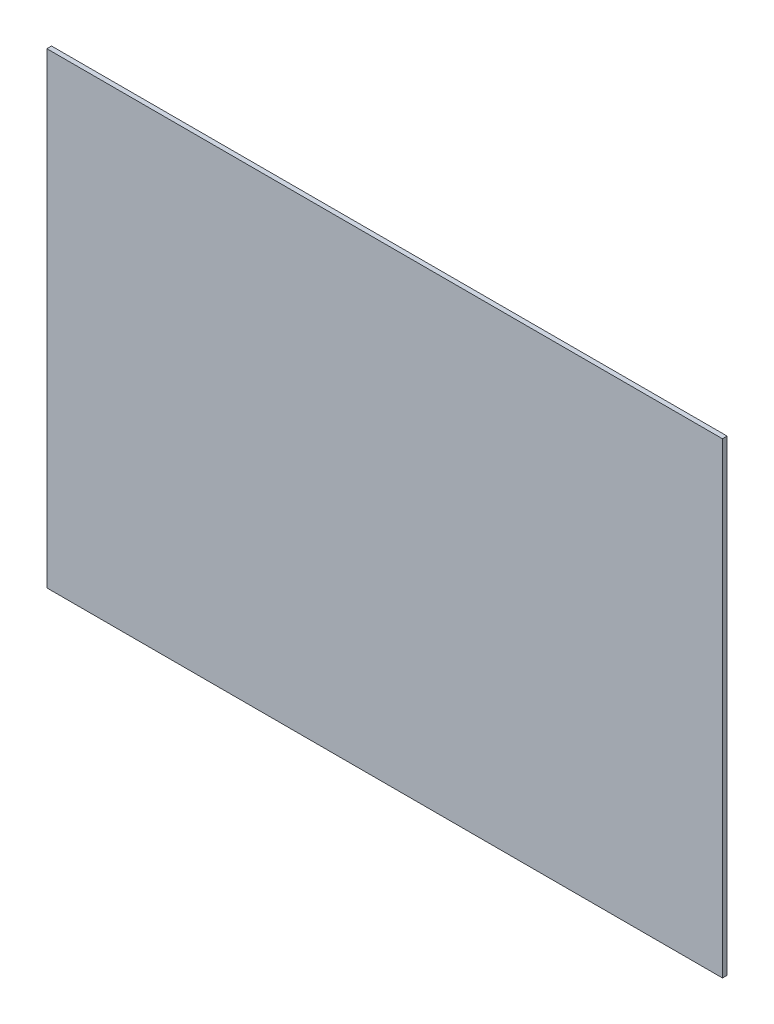
ISO-10303-21;
HEADER;
FILE_DESCRIPTION(('STEP AP214'),'2;1');
FILE_NAME('part.step','',(''),(''),'','','');
FILE_SCHEMA(('AUTOMOTIVE_DESIGN { 1 0 10303 214 1 1 1 1 }'));
ENDSEC;
DATA;
#1=APPLICATION_CONTEXT('core data for automotive mechanical design processes');
#2=APPLICATION_PROTOCOL_DEFINITION('international standard','automotive_design',2000,#1);
#3=PRODUCT_CONTEXT('',#1,'mechanical');
#4=PRODUCT('Part','Part','',(#3));
#5=PRODUCT_RELATED_PRODUCT_CATEGORY('part','',(#4));
#6=PRODUCT_DEFINITION_FORMATION('','',#4);
#7=PRODUCT_DEFINITION_CONTEXT('part definition',#1,'design');
#8=PRODUCT_DEFINITION('design','',#6,#7);
#9=PRODUCT_DEFINITION_SHAPE('','',#8);
#10=(LENGTH_UNIT() NAMED_UNIT(*) SI_UNIT(.MILLI.,.METRE.));
#11=(NAMED_UNIT(*) PLANE_ANGLE_UNIT() SI_UNIT($,.RADIAN.));
#12=(NAMED_UNIT(*) SI_UNIT($,.STERADIAN.) SOLID_ANGLE_UNIT());
#13=UNCERTAINTY_MEASURE_WITH_UNIT(LENGTH_MEASURE(1.E-05),#10,'distance_accuracy_value','');
#14=(GEOMETRIC_REPRESENTATION_CONTEXT(3) GLOBAL_UNCERTAINTY_ASSIGNED_CONTEXT((#13)) GLOBAL_UNIT_ASSIGNED_CONTEXT((#10,
#11,#12)) REPRESENTATION_CONTEXT('',''));
#15=CARTESIAN_POINT('',(0.,0.,0.));
#16=DIRECTION('',(0.,0.,1.));
#17=DIRECTION('',(1.,0.,0.));
#18=AXIS2_PLACEMENT_3D('',#15,#16,#17);
#19=CARTESIAN_POINT('',(217.,150.,3.));
#20=DIRECTION('',(-1.,0.,0.));
#21=DIRECTION('',(0.,-1.,0.));
#22=AXIS2_PLACEMENT_3D('',#19,#20,#21);
#23=PLANE('',#22);
#24=DIRECTION('',(0.,1.,0.));
#25=VECTOR('',#24,1.);
#26=CARTESIAN_POINT('',(217.,150.,0.));
#27=LINE('',#26,#25);
#28=CARTESIAN_POINT('',(217.,-150.,0.));
#29=VERTEX_POINT('',#28);
#30=CARTESIAN_POINT('',(217.,150.,0.));
#31=VERTEX_POINT('',#30);
#32=EDGE_CURVE('E100',#29,#31,#27,.T.);
#33=ORIENTED_EDGE('',*,*,#32,.T.);
#34=DIRECTION('',(0.,0.,-1.));
#35=VECTOR('',#34,1.);
#36=CARTESIAN_POINT('',(217.,150.,3.));
#37=LINE('',#36,#35);
#38=CARTESIAN_POINT('',(217.,150.,3.));
#39=VERTEX_POINT('',#38);
#40=EDGE_CURVE('E11',#39,#31,#37,.T.);
#41=ORIENTED_EDGE('',*,*,#40,.F.);
#42=DIRECTION('',(0.,1.,0.));
#43=VECTOR('',#42,1.);
#44=CARTESIAN_POINT('',(217.,150.,3.));
#45=LINE('',#44,#43);
#46=CARTESIAN_POINT('',(217.,-150.,3.));
#47=VERTEX_POINT('',#46);
#48=EDGE_CURVE('E88',#47,#39,#45,.T.);
#49=ORIENTED_EDGE('',*,*,#48,.F.);
#50=DIRECTION('',(0.,0.,-1.));
#51=VECTOR('',#50,1.);
#52=CARTESIAN_POINT('',(217.,-150.,3.));
#53=LINE('',#52,#51);
#54=EDGE_CURVE('E96',#47,#29,#53,.T.);
#55=ORIENTED_EDGE('',*,*,#54,.T.);
#56=EDGE_LOOP('',(#33,#41,#49,#55));
#57=FACE_BOUND('',#56,.T.);
#58=ADVANCED_FACE('F37',(#57),#23,.F.);
#59=CARTESIAN_POINT('',(-217.,150.,3.));
#60=DIRECTION('',(0.,-1.,0.));
#61=DIRECTION('',(0.,0.,-1.));
#62=AXIS2_PLACEMENT_3D('',#59,#60,#61);
#63=PLANE('',#62);
#64=DIRECTION('',(-1.,0.,0.));
#65=VECTOR('',#64,1.);
#66=CARTESIAN_POINT('',(-217.,150.,0.));
#67=LINE('',#66,#65);
#68=CARTESIAN_POINT('',(-217.,150.,0.));
#69=VERTEX_POINT('',#68);
#70=EDGE_CURVE('E92',#31,#69,#67,.T.);
#71=ORIENTED_EDGE('',*,*,#70,.T.);
#72=DIRECTION('',(0.,0.,-1.));
#73=VECTOR('',#72,1.);
#74=CARTESIAN_POINT('',(-217.,150.,3.));
#75=LINE('',#74,#73);
#76=CARTESIAN_POINT('',(-217.,150.,3.));
#77=VERTEX_POINT('',#76);
#78=EDGE_CURVE('E45',#77,#69,#75,.T.);
#79=ORIENTED_EDGE('',*,*,#78,.F.);
#80=DIRECTION('',(-1.,0.,0.));
#81=VECTOR('',#80,1.);
#82=CARTESIAN_POINT('',(-217.,150.,3.));
#83=LINE('',#82,#81);
#84=EDGE_CURVE('E83',#39,#77,#83,.T.);
#85=ORIENTED_EDGE('',*,*,#84,.F.);
#86=ORIENTED_EDGE('',*,*,#40,.T.);
#87=EDGE_LOOP('',(#71,#79,#85,#86));
#88=FACE_BOUND('',#87,.T.);
#89=ADVANCED_FACE('F91',(#88),#63,.F.);
#90=CARTESIAN_POINT('',(-217.,150.,3.));
#91=DIRECTION('',(1.,0.,0.));
#92=DIRECTION('',(0.,1.,0.));
#93=AXIS2_PLACEMENT_3D('',#90,#91,#92);
#94=PLANE('',#93);
#95=DIRECTION('',(0.,-1.,0.));
#96=VECTOR('',#95,1.);
#97=CARTESIAN_POINT('',(-217.,150.,0.));
#98=LINE('',#97,#96);
#99=CARTESIAN_POINT('',(-217.,-150.,0.));
#100=VERTEX_POINT('',#99);
#101=EDGE_CURVE('E70',#69,#100,#98,.T.);
#102=ORIENTED_EDGE('',*,*,#101,.T.);
#103=DIRECTION('',(0.,0.,-1.));
#104=VECTOR('',#103,1.);
#105=CARTESIAN_POINT('',(-217.,-150.,3.));
#106=LINE('',#105,#104);
#107=CARTESIAN_POINT('',(-217.,-150.,3.));
#108=VERTEX_POINT('',#107);
#109=EDGE_CURVE('E93',#108,#100,#106,.T.);
#110=ORIENTED_EDGE('',*,*,#109,.F.);
#111=DIRECTION('',(0.,-1.,0.));
#112=VECTOR('',#111,1.);
#113=CARTESIAN_POINT('',(-217.,150.,3.));
#114=LINE('',#113,#112);
#115=EDGE_CURVE('E86',#77,#108,#114,.T.);
#116=ORIENTED_EDGE('',*,*,#115,.F.);
#117=ORIENTED_EDGE('',*,*,#78,.T.);
#118=EDGE_LOOP('',(#102,#110,#116,#117));
#119=FACE_BOUND('',#118,.T.);
#120=ADVANCED_FACE('F94',(#119),#94,.F.);
#121=CARTESIAN_POINT('',(-217.,-150.,3.));
#122=DIRECTION('',(0.,1.,0.));
#123=DIRECTION('',(0.,0.,1.));
#124=AXIS2_PLACEMENT_3D('',#121,#122,#123);
#125=PLANE('',#124);
#126=DIRECTION('',(1.,0.,0.));
#127=VECTOR('',#126,1.);
#128=CARTESIAN_POINT('',(-217.,-150.,0.));
#129=LINE('',#128,#127);
#130=EDGE_CURVE('E76',#100,#29,#129,.T.);
#131=ORIENTED_EDGE('',*,*,#130,.T.);
#132=ORIENTED_EDGE('',*,*,#54,.F.);
#133=DIRECTION('',(1.,0.,0.));
#134=VECTOR('',#133,1.);
#135=CARTESIAN_POINT('',(-217.,-150.,3.));
#136=LINE('',#135,#134);
#137=EDGE_CURVE('E53',#108,#47,#136,.T.);
#138=ORIENTED_EDGE('',*,*,#137,.F.);
#139=ORIENTED_EDGE('',*,*,#109,.T.);
#140=EDGE_LOOP('',(#131,#132,#138,#139));
#141=FACE_BOUND('',#140,.T.);
#142=ADVANCED_FACE('F107',(#141),#125,.F.);
#143=CARTESIAN_POINT('',(0.,0.,3.));
#144=DIRECTION('',(0.,0.,1.));
#145=DIRECTION('',(1.,0.,0.));
#146=AXIS2_PLACEMENT_3D('',#143,#144,#145);
#147=PLANE('',#146);
#148=ORIENTED_EDGE('',*,*,#48,.T.);
#149=ORIENTED_EDGE('',*,*,#84,.T.);
#150=ORIENTED_EDGE('',*,*,#115,.T.);
#151=ORIENTED_EDGE('',*,*,#137,.T.);
#152=EDGE_LOOP('',(#148,#149,#150,#151));
#153=FACE_BOUND('',#152,.T.);
#154=ADVANCED_FACE('F84',(#153),#147,.T.);
#155=CARTESIAN_POINT('',(0.,0.,0.));
#156=DIRECTION('',(0.,0.,1.));
#157=DIRECTION('',(1.,0.,0.));
#158=AXIS2_PLACEMENT_3D('',#155,#156,#157);
#159=PLANE('',#158);
#160=ORIENTED_EDGE('',*,*,#32,.F.);
#161=ORIENTED_EDGE('',*,*,#130,.F.);
#162=ORIENTED_EDGE('',*,*,#101,.F.);
#163=ORIENTED_EDGE('',*,*,#70,.F.);
#164=EDGE_LOOP('',(#160,#161,#162,#163));
#165=FACE_BOUND('',#164,.T.);
#166=ADVANCED_FACE('F110',(#165),#159,.F.);
#167=CLOSED_SHELL('',(#58,#89,#120,#142,#154,#166));
#168=MANIFOLD_SOLID_BREP('B2',#167);
#169=ADVANCED_BREP_SHAPE_REPRESENTATION('',(#18,#168),#14);
#170=SHAPE_DEFINITION_REPRESENTATION(#9,#169);
ENDSEC;
END-ISO-10303-21;
